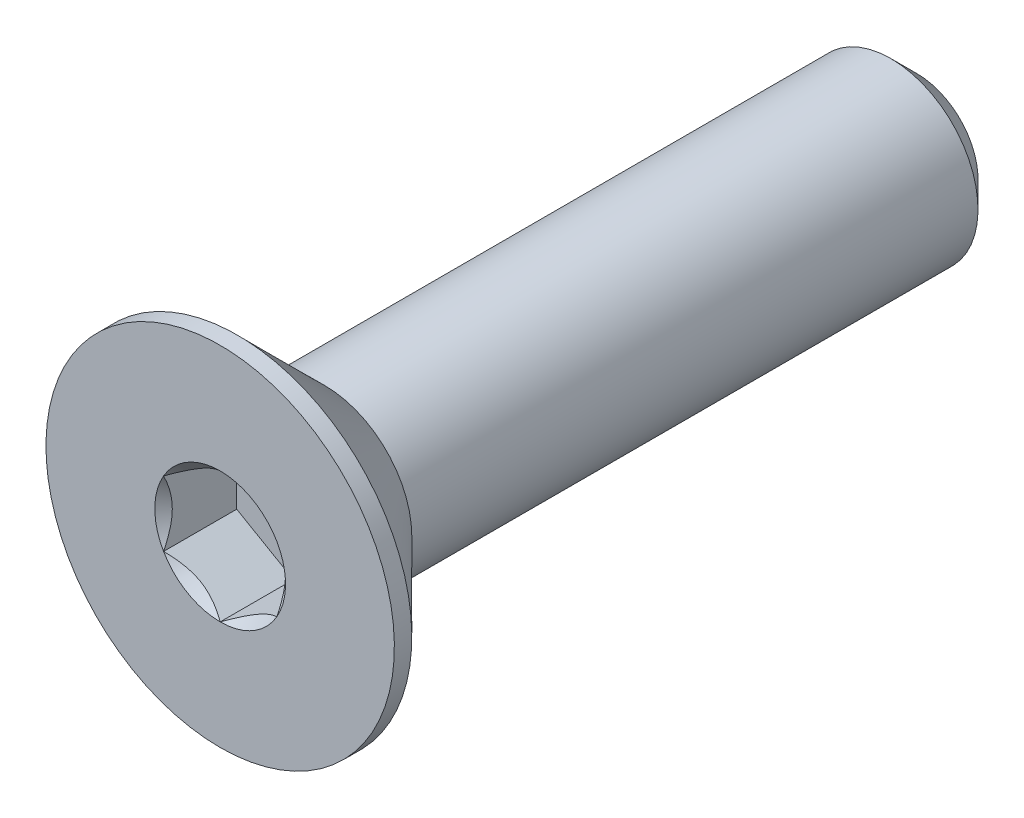
ISO-10303-21;
HEADER;
FILE_DESCRIPTION(('STEP AP214'),'2;1');
FILE_NAME('part.step','',(''),(''),'','','');
FILE_SCHEMA(('AUTOMOTIVE_DESIGN { 1 0 10303 214 1 1 1 1 }'));
ENDSEC;
DATA;
#1=APPLICATION_CONTEXT('core data for automotive mechanical design processes');
#2=APPLICATION_PROTOCOL_DEFINITION('international standard','automotive_design',2000,#1);
#3=PRODUCT_CONTEXT('',#1,'mechanical');
#4=PRODUCT('Part','Part','',(#3));
#5=PRODUCT_RELATED_PRODUCT_CATEGORY('part','',(#4));
#6=PRODUCT_DEFINITION_FORMATION('','',#4);
#7=PRODUCT_DEFINITION_CONTEXT('part definition',#1,'design');
#8=PRODUCT_DEFINITION('design','',#6,#7);
#9=PRODUCT_DEFINITION_SHAPE('','',#8);
#10=(LENGTH_UNIT() NAMED_UNIT(*) SI_UNIT(.MILLI.,.METRE.));
#11=(NAMED_UNIT(*) PLANE_ANGLE_UNIT() SI_UNIT($,.RADIAN.));
#12=(NAMED_UNIT(*) SI_UNIT($,.STERADIAN.) SOLID_ANGLE_UNIT());
#13=UNCERTAINTY_MEASURE_WITH_UNIT(LENGTH_MEASURE(1.E-05),#10,'distance_accuracy_value','');
#14=(GEOMETRIC_REPRESENTATION_CONTEXT(3) GLOBAL_UNCERTAINTY_ASSIGNED_CONTEXT((#13)) GLOBAL_UNIT_ASSIGNED_CONTEXT((#10,
#11,#12)) REPRESENTATION_CONTEXT('',''));
#15=CARTESIAN_POINT('',(0.,0.,0.));
#16=DIRECTION('',(0.,0.,1.));
#17=DIRECTION('',(1.,0.,0.));
#18=AXIS2_PLACEMENT_3D('',#15,#16,#17);
#19=CARTESIAN_POINT('',(0.,0.,-8.));
#20=DIRECTION('',(0.,0.,-1.));
#21=DIRECTION('',(0.,1.,0.));
#22=AXIS2_PLACEMENT_3D('',#19,#20,#21);
#23=CYLINDRICAL_SURFACE('',#22,0.999999999999998);
#24=CARTESIAN_POINT('',(0.,0.,-7.7));
#25=DIRECTION('',(0.,0.,-1.));
#26=DIRECTION('',(0.,1.,0.));
#27=AXIS2_PLACEMENT_3D('',#24,#25,#26);
#28=CIRCLE('',#27,0.999999999999998);
#29=CARTESIAN_POINT('',(0.,0.999999999999998,-7.7));
#30=VERTEX_POINT('',#29);
#31=EDGE_CURVE('E48',#30,#30,#28,.F.);
#32=ORIENTED_EDGE('',*,*,#31,.T.);
#33=EDGE_LOOP('',(#32));
#34=FACE_BOUND('',#33,.T.);
#35=CARTESIAN_POINT('',(0.,0.,-1.19999999999999));
#36=DIRECTION('',(0.,0.,1.));
#37=DIRECTION('',(0.,-1.,0.));
#38=AXIS2_PLACEMENT_3D('',#35,#36,#37);
#39=CIRCLE('',#38,1.00000000000001);
#40=CARTESIAN_POINT('',(0.,-1.00000000000001,-1.19999999999999));
#41=VERTEX_POINT('',#40);
#42=EDGE_CURVE('E166',#41,#41,#39,.T.);
#43=ORIENTED_EDGE('',*,*,#42,.F.);
#44=EDGE_LOOP('',(#43));
#45=FACE_BOUND('',#44,.T.);
#46=ADVANCED_FACE('F35',(#34,#45),#23,.T.);
#47=CARTESIAN_POINT('',(0.,-1.,-8.));
#48=DIRECTION('',(0.,0.,-1.));
#49=DIRECTION('',(0.,1.,0.));
#50=AXIS2_PLACEMENT_3D('',#47,#48,#49);
#51=PLANE('',#50);
#52=CARTESIAN_POINT('',(0.,0.,-8.));
#53=DIRECTION('',(0.,0.,-1.));
#54=DIRECTION('',(0.,1.,0.));
#55=AXIS2_PLACEMENT_3D('',#52,#53,#54);
#56=CIRCLE('',#55,0.700000000000001);
#57=CARTESIAN_POINT('',(0.,0.700000000000001,-8.));
#58=VERTEX_POINT('',#57);
#59=EDGE_CURVE('E175',#58,#58,#56,.T.);
#60=ORIENTED_EDGE('',*,*,#59,.T.);
#61=EDGE_LOOP('',(#60));
#62=FACE_BOUND('',#61,.T.);
#63=ADVANCED_FACE('F185',(#62),#51,.T.);
#64=CARTESIAN_POINT('',(0.,0.,-8.));
#65=DIRECTION('',(0.,0.,1.));
#66=DIRECTION('',(0.,-1.,0.));
#67=AXIS2_PLACEMENT_3D('',#64,#65,#66);
#68=CONICAL_SURFACE('',#67,0.700000000000001,0.785398163397445);
#69=ORIENTED_EDGE('',*,*,#31,.F.);
#70=EDGE_LOOP('',(#69));
#71=FACE_BOUND('',#70,.T.);
#72=ORIENTED_EDGE('',*,*,#59,.F.);
#73=EDGE_LOOP('',(#72));
#74=FACE_BOUND('',#73,.T.);
#75=ADVANCED_FACE('F37',(#71,#74),#68,.T.);
#76=CARTESIAN_POINT('',(0.,0.,0.));
#77=DIRECTION('',(0.,0.,1.));
#78=DIRECTION('',(0.,-1.,0.));
#79=AXIS2_PLACEMENT_3D('',#76,#77,#78);
#80=CYLINDRICAL_SURFACE('',#79,2.);
#81=CARTESIAN_POINT('',(0.,0.,0.));
#82=DIRECTION('',(0.,0.,1.));
#83=DIRECTION('',(0.,-1.,0.));
#84=AXIS2_PLACEMENT_3D('',#81,#82,#83);
#85=CIRCLE('',#84,1.99999999999999);
#86=CARTESIAN_POINT('',(0.,-1.99999999999999,0.));
#87=VERTEX_POINT('',#86);
#88=EDGE_CURVE('E172',#87,#87,#85,.T.);
#89=ORIENTED_EDGE('',*,*,#88,.F.);
#90=EDGE_LOOP('',(#89));
#91=FACE_BOUND('',#90,.T.);
#92=CARTESIAN_POINT('',(0.,0.,-0.199999999999994));
#93=DIRECTION('',(0.,0.,1.));
#94=DIRECTION('',(0.,-1.,0.));
#95=AXIS2_PLACEMENT_3D('',#92,#93,#94);
#96=CIRCLE('',#95,2.);
#97=CARTESIAN_POINT('',(0.,-2.,-0.199999999999984));
#98=VERTEX_POINT('',#97);
#99=EDGE_CURVE('E169',#98,#98,#96,.T.);
#100=ORIENTED_EDGE('',*,*,#99,.T.);
#101=EDGE_LOOP('',(#100));
#102=FACE_BOUND('',#101,.T.);
#103=ADVANCED_FACE('F184',(#91,#102),#80,.T.);
#104=CARTESIAN_POINT('',(0.,0.,-1.19999999999999));
#105=DIRECTION('',(0.,0.,1.));
#106=DIRECTION('',(0.,-1.,0.));
#107=AXIS2_PLACEMENT_3D('',#104,#105,#106);
#108=CONICAL_SURFACE('',#107,1.00000000000001,0.785398163397445);
#109=ORIENTED_EDGE('',*,*,#99,.F.);
#110=EDGE_LOOP('',(#109));
#111=FACE_BOUND('',#110,.T.);
#112=ORIENTED_EDGE('',*,*,#42,.T.);
#113=EDGE_LOOP('',(#112));
#114=FACE_BOUND('',#113,.T.);
#115=ADVANCED_FACE('F195',(#111,#114),#108,.T.);
#116=CARTESIAN_POINT('',(0.,-0.999999999999995,0.));
#117=DIRECTION('',(0.,0.,1.));
#118=DIRECTION('',(0.,-1.,0.));
#119=AXIS2_PLACEMENT_3D('',#116,#117,#118);
#120=PLANE('',#119);
#121=CARTESIAN_POINT('',(0.,0.,0.));
#122=DIRECTION('',(0.,0.,1.));
#123=DIRECTION('',(1.,0.,0.));
#124=AXIS2_PLACEMENT_3D('',#121,#122,#123);
#125=CIRCLE('',#124,0.750555349946514);
#126=CARTESIAN_POINT('',(0.,-0.750555349946514,0.));
#127=VERTEX_POINT('',#126);
#128=CARTESIAN_POINT('',(0.649999999999999,-0.375277674973259,0.));
#129=VERTEX_POINT('',#128);
#130=EDGE_CURVE('E94',#127,#129,#125,.T.);
#131=ORIENTED_EDGE('',*,*,#130,.F.);
#132=CARTESIAN_POINT('',(-0.65,-0.375277674973256,0.));
#133=VERTEX_POINT('',#132);
#134=EDGE_CURVE('E54',#133,#127,#125,.T.);
#135=ORIENTED_EDGE('',*,*,#134,.F.);
#136=CARTESIAN_POINT('',(-0.65,0.375277674973257,0.));
#137=VERTEX_POINT('',#136);
#138=EDGE_CURVE('E136',#137,#133,#125,.T.);
#139=ORIENTED_EDGE('',*,*,#138,.F.);
#140=CARTESIAN_POINT('',(0.,0.750555349946514,0.));
#141=VERTEX_POINT('',#140);
#142=EDGE_CURVE('E61',#141,#137,#125,.T.);
#143=ORIENTED_EDGE('',*,*,#142,.F.);
#144=CARTESIAN_POINT('',(0.65,0.375277674973259,0.));
#145=VERTEX_POINT('',#144);
#146=EDGE_CURVE('E130',#145,#141,#125,.T.);
#147=ORIENTED_EDGE('',*,*,#146,.F.);
#148=EDGE_CURVE('E102',#129,#145,#125,.T.);
#149=ORIENTED_EDGE('',*,*,#148,.F.);
#150=EDGE_LOOP('',(#131,#135,#139,#143,#147,#149));
#151=FACE_BOUND('',#150,.T.);
#152=ORIENTED_EDGE('',*,*,#88,.T.);
#153=EDGE_LOOP('',(#152));
#154=FACE_BOUND('',#153,.T.);
#155=ADVANCED_FACE('F128',(#151,#154),#120,.T.);
#156=CARTESIAN_POINT('',(0.,0.,0.));
#157=DIRECTION('',(0.,0.,1.));
#158=DIRECTION('',(1.,0.,0.));
#159=AXIS2_PLACEMENT_3D('',#156,#157,#158);
#160=CONICAL_SURFACE('',#159,0.750555349946514,0.78539816339745);
#161=ORIENTED_EDGE('',*,*,#148,.T.);
#162=CARTESIAN_POINT('',(0.649999999999999,-0.748456856202001,0.240750690384009));
#163=CARTESIAN_POINT('',(0.649999999999999,-0.711991073878824,0.213280285933624));
#164=CARTESIAN_POINT('',(0.649999999999999,-0.675139640082802,0.186265195476197));
#165=CARTESIAN_POINT('',(0.649999999999999,-0.600031183452826,0.133629348283165));
#166=CARTESIAN_POINT('',(0.649999999999999,-0.5617654412709,0.108021106129099));
#167=CARTESIAN_POINT('',(0.649999999999999,-0.481525479406325,0.0577374937624623));
#168=CARTESIAN_POINT('',(0.649999999999999,-0.43946425367049,0.0331988021987563));
#169=CARTESIAN_POINT('',(0.649999999999999,-0.353242719412722,-0.0116853403013642));
#170=CARTESIAN_POINT('',(0.649999999999999,-0.309090130602528,-0.0320449275105121));
#171=CARTESIAN_POINT('',(0.649999999999999,-0.242810057498672,-0.0569512709113486));
#172=CARTESIAN_POINT('',(0.649999999999999,-0.221667349821691,-0.0640992725852885));
#173=CARTESIAN_POINT('',(0.649999999999999,-0.178882845085544,-0.076702470547455));
#174=CARTESIAN_POINT('',(0.649999999999999,-0.157241013753965,-0.0821575502168753));
#175=CARTESIAN_POINT('',(0.649999999999999,-0.0924732258239357,-0.0953392346897772));
#176=CARTESIAN_POINT('',(0.649999999999999,-0.0486986201802788,-0.100206440230562));
#177=CARTESIAN_POINT('',(0.649999999999999,0.0373331587621226,-0.100855510769223));
#178=CARTESIAN_POINT('',(0.65,0.0795879418799254,-0.0969596606801959));
#179=CARTESIAN_POINT('',(0.65,0.142230570834974,-0.0855076744021686));
#180=CARTESIAN_POINT('',(0.65,0.163174856664668,-0.0806854357632721));
#181=CARTESIAN_POINT('',(0.65,0.204615212735412,-0.0693999000452593));
#182=CARTESIAN_POINT('',(0.65,0.225111320324616,-0.0629367402798584));
#183=CARTESIAN_POINT('',(0.65,0.289638534772369,-0.0401559078683602));
#184=CARTESIAN_POINT('',(0.65,0.332748206875049,-0.0212427548658019));
#185=CARTESIAN_POINT('',(0.65,0.416943840013232,0.0208112818887771));
#186=CARTESIAN_POINT('',(0.65,0.458021834530768,0.0439673547577746));
#187=CARTESIAN_POINT('',(0.65,0.536529233245988,0.091726639718087));
#188=CARTESIAN_POINT('',(0.65,0.57403850913462,0.116200758127151));
#189=CARTESIAN_POINT('',(0.65,0.647609691485455,0.166623456014881));
#190=CARTESIAN_POINT('',(0.65,0.683680924535917,0.192558343655286));
#191=CARTESIAN_POINT('',(0.65,0.719356204751139,0.218966877397429));
#192=B_SPLINE_CURVE_WITH_KNOTS('',3,(#162,#163,#164,#165,#166,#167,#168,#169,#170,#171,#172,
#173,#174,#175,#176,#177,#178,#179,#180,#181,#182,#183,#184,#185,#186,#187,#188,#189,#190,#191),
.UNSPECIFIED.,.F.,.F.,(4,2,2,2,2,2,2,2,2,2,2,2,2,2,4),(0.,0.13701403000958,0.275096405762554,
0.421060359835526,0.566522128775096,0.633415056462923,0.700312591121807,0.831534924508342,
0.958010408789905,1.02242898521266,1.08684217280829,1.22766018796413,1.36899252873704,
1.50330165960873,1.63651263433843),.UNSPECIFIED.);
#193=EDGE_CURVE('E11',#129,#145,#192,.T.);
#194=ORIENTED_EDGE('',*,*,#193,.F.);
#195=EDGE_LOOP('',(#161,#194));
#196=FACE_BOUND('',#195,.T.);
#197=ADVANCED_FACE('F106',(#196),#160,.F.);
#198=ORIENTED_EDGE('',*,*,#146,.T.);
#199=CARTESIAN_POINT('',(0.6502,0.37516220491942,0.000115496696673458));
#200=CARTESIAN_POINT('',(0.627846124557379,0.388068220923648,-0.0127826378084543));
#201=CARTESIAN_POINT('',(0.605119879467387,0.401189224644024,-0.0249248451013638));
#202=CARTESIAN_POINT('',(0.558778015356717,0.427944712363069,-0.0471577551377742));
#203=CARTESIAN_POINT('',(0.535157980959403,0.441581745580626,-0.0572360751899936));
#204=CARTESIAN_POINT('',(0.487526191293144,0.469081972166424,-0.0744984835766256));
#205=CARTESIAN_POINT('',(0.463526635406914,0.482938122217771,-0.081726041484421));
#206=CARTESIAN_POINT('',(0.415010589754791,0.51094887423504,-0.0928707979999935));
#207=CARTESIAN_POINT('',(0.390495555958119,0.525102635596742,-0.0967962973781322));
#208=CARTESIAN_POINT('',(0.33061559766408,0.559674345636868,-0.101776562665293));
#209=CARTESIAN_POINT('',(0.295110807096765,0.580173046028429,-0.100875515207342));
#210=CARTESIAN_POINT('',(0.224845447682006,0.620740770201246,-0.0915914386833312));
#211=CARTESIAN_POINT('',(0.190086069560698,0.640809106516447,-0.0831972369703435));
#212=CARTESIAN_POINT('',(0.129041737491061,0.676053068069353,-0.0629543214927022));
#213=CARTESIAN_POINT('',(0.102476138584915,0.691390723749,-0.0521615767354974));
#214=CARTESIAN_POINT('',(0.0503858451009331,0.721465068714143,-0.0278480685503982));
#215=CARTESIAN_POINT('',(0.024858081174964,0.736203530088611,-0.0143361789927107));
#216=CARTESIAN_POINT('',(-0.000200000000000232,0.750670820000352,0.000115496696674045));
#217=B_SPLINE_CURVE_WITH_KNOTS('',3,(#199,#200,#201,#202,#203,#204,#205,#206,#207,#208,#209,
#210,#211,#212,#213,#214,#215,#216),.UNSPECIFIED.,.F.,.F.,(4,2,2,2,2,2,2,2,4),(0.,
0.0866236559063443,0.173752711623242,0.259496442803568,0.345023980281752,0.467267720550125,
0.589694037029335,0.68711130875548,0.784215671813665),.UNSPECIFIED.);
#218=EDGE_CURVE('E132',#145,#141,#217,.T.);
#219=ORIENTED_EDGE('',*,*,#218,.F.);
#220=EDGE_LOOP('',(#198,#219));
#221=FACE_BOUND('',#220,.T.);
#222=ADVANCED_FACE('F271',(#221),#160,.F.);
#223=ORIENTED_EDGE('',*,*,#142,.T.);
#224=CARTESIAN_POINT('',(0.0001999999999998,0.750670820000352,0.000115496696674086));
#225=CARTESIAN_POINT('',(-0.0221538754426208,0.737764803996124,-0.0127826378084538));
#226=CARTESIAN_POINT('',(-0.0448801205326128,0.724643800275747,-0.0249248451013632));
#227=CARTESIAN_POINT('',(-0.0912219846432827,0.697888312556703,-0.0471577551377738));
#228=CARTESIAN_POINT('',(-0.114842019040597,0.684251279339146,-0.0572360751899932));
#229=CARTESIAN_POINT('',(-0.162473808706856,0.656751052753347,-0.0744984835766253));
#230=CARTESIAN_POINT('',(-0.186473364593086,0.642894902702001,-0.0817260414844208));
#231=CARTESIAN_POINT('',(-0.23498941024521,0.614884150684731,-0.0928707979999933));
#232=CARTESIAN_POINT('',(-0.259504444041881,0.60073038932303,-0.0967962973781321));
#233=CARTESIAN_POINT('',(-0.31938440233592,0.566158679282903,-0.101776562665293));
#234=CARTESIAN_POINT('',(-0.354889192903236,0.545659978891342,-0.100875515207342));
#235=CARTESIAN_POINT('',(-0.425154552317995,0.505092254718525,-0.0915914386833311));
#236=CARTESIAN_POINT('',(-0.459913930439302,0.485023918403324,-0.0831972369703433));
#237=CARTESIAN_POINT('',(-0.52095826250894,0.449779956850418,-0.0629543214927021));
#238=CARTESIAN_POINT('',(-0.547523861415086,0.434442301170771,-0.0521615767354973));
#239=CARTESIAN_POINT('',(-0.599614154899067,0.404367956205628,-0.0278480685503983));
#240=CARTESIAN_POINT('',(-0.625141918825036,0.38962949483116,-0.0143361789927108));
#241=CARTESIAN_POINT('',(-0.6502,0.375162204919419,0.000115496696673951));
#242=B_SPLINE_CURVE_WITH_KNOTS('',3,(#224,#225,#226,#227,#228,#229,#230,#231,#232,#233,#234,
#235,#236,#237,#238,#239,#240,#241),.UNSPECIFIED.,.F.,.F.,(4,2,2,2,2,2,2,2,4),(0.,
0.0866236559063444,0.173752711623242,0.259496442803568,0.345023980281753,0.467267720550126,
0.589694037029337,0.687111308755481,0.784215671813666),.UNSPECIFIED.);
#243=EDGE_CURVE('E135',#141,#137,#242,.T.);
#244=ORIENTED_EDGE('',*,*,#243,.F.);
#245=EDGE_LOOP('',(#223,#244));
#246=FACE_BOUND('',#245,.T.);
#247=ADVANCED_FACE('F267',(#246),#160,.F.);
#248=ORIENTED_EDGE('',*,*,#138,.T.);
#249=CARTESIAN_POINT('',(-0.65,-0.748456856202,0.240750690384009));
#250=CARTESIAN_POINT('',(-0.65,-0.711991073878823,0.213280285933624));
#251=CARTESIAN_POINT('',(-0.65,-0.675139640082801,0.186265195476196));
#252=CARTESIAN_POINT('',(-0.65,-0.600031183452825,0.133629348283165));
#253=CARTESIAN_POINT('',(-0.65,-0.561765441270899,0.108021106129099));
#254=CARTESIAN_POINT('',(-0.65,-0.481525479406325,0.0577374937624624));
#255=CARTESIAN_POINT('',(-0.65,-0.439464253670489,0.0331988021987566));
#256=CARTESIAN_POINT('',(-0.65,-0.353242719412722,-0.0116853403013638));
#257=CARTESIAN_POINT('',(-0.65,-0.309090130602527,-0.0320449275105118));
#258=CARTESIAN_POINT('',(-0.65,-0.242810057498671,-0.0569512709113481));
#259=CARTESIAN_POINT('',(-0.65,-0.22166734982169,-0.0640992725852878));
#260=CARTESIAN_POINT('',(-0.65,-0.178882845085544,-0.0767024705474542));
#261=CARTESIAN_POINT('',(-0.65,-0.157241013753965,-0.0821575502168746));
#262=CARTESIAN_POINT('',(-0.65,-0.0924732258239351,-0.0953392346897765));
#263=CARTESIAN_POINT('',(-0.65,-0.0486986201802782,-0.100206440230561));
#264=CARTESIAN_POINT('',(-0.65,0.0373331587621233,-0.100855510769222));
#265=CARTESIAN_POINT('',(-0.65,0.0795879418799262,-0.096959660680195));
#266=CARTESIAN_POINT('',(-0.65,0.142230570834975,-0.0855076744021676));
#267=CARTESIAN_POINT('',(-0.65,0.163174856664668,-0.0806854357632711));
#268=CARTESIAN_POINT('',(-0.65,0.204615212735413,-0.0693999000452582));
#269=CARTESIAN_POINT('',(-0.65,0.225111320324616,-0.0629367402798573));
#270=CARTESIAN_POINT('',(-0.65,0.28963853477237,-0.0401559078683591));
#271=CARTESIAN_POINT('',(-0.65,0.33274820687505,-0.0212427548658007));
#272=CARTESIAN_POINT('',(-0.65,0.416943840013233,0.0208112818887785));
#273=CARTESIAN_POINT('',(-0.65,0.458021834530769,0.043967354757776));
#274=CARTESIAN_POINT('',(-0.65,0.536529233245989,0.0917266397180885));
#275=CARTESIAN_POINT('',(-0.65,0.574038509134621,0.116200758127153));
#276=CARTESIAN_POINT('',(-0.65,0.647609691485456,0.166623456014883));
#277=CARTESIAN_POINT('',(-0.65,0.683680924535919,0.192558343655288));
#278=CARTESIAN_POINT('',(-0.65,0.719356204751141,0.218966877397431));
#279=B_SPLINE_CURVE_WITH_KNOTS('',3,(#249,#250,#251,#252,#253,#254,#255,#256,#257,#258,#259,
#260,#261,#262,#263,#264,#265,#266,#267,#268,#269,#270,#271,#272,#273,#274,#275,#276,#277,#278),
.UNSPECIFIED.,.F.,.F.,(4,2,2,2,2,2,2,2,2,2,2,2,2,2,4),(0.,0.13701403000958,0.275096405762554,
0.421060359835526,0.566522128775095,0.633415056462922,0.700312591121806,0.831534924508341,
0.958010408789904,1.02242898521266,1.08684217280829,1.22766018796413,1.36899252873704,
1.50330165960874,1.63651263433843),.UNSPECIFIED.);
#280=EDGE_CURVE('E142',#137,#133,#279,.F.);
#281=ORIENTED_EDGE('',*,*,#280,.F.);
#282=EDGE_LOOP('',(#248,#281));
#283=FACE_BOUND('',#282,.T.);
#284=ADVANCED_FACE('F140',(#283),#160,.F.);
#285=ORIENTED_EDGE('',*,*,#134,.T.);
#286=CARTESIAN_POINT('',(-0.6502,-0.375162204919418,0.000115496696673349));
#287=CARTESIAN_POINT('',(-0.62784612455738,-0.388068220923647,-0.0127826378084544));
#288=CARTESIAN_POINT('',(-0.605119879467388,-0.401189224644023,-0.0249248451013639));
#289=CARTESIAN_POINT('',(-0.558778015356718,-0.427944712363067,-0.0471577551377745));
#290=CARTESIAN_POINT('',(-0.535157980959404,-0.441581745580625,-0.057236075189994));
#291=CARTESIAN_POINT('',(-0.487526191293144,-0.469081972166423,-0.0744984835766262));
#292=CARTESIAN_POINT('',(-0.463526635406914,-0.48293812221777,-0.0817260414844217));
#293=CARTESIAN_POINT('',(-0.415010589754791,-0.510948874235039,-0.0928707979999942));
#294=CARTESIAN_POINT('',(-0.390495555958119,-0.525102635596741,-0.096796297378133));
#295=CARTESIAN_POINT('',(-0.33061559766408,-0.559674345636868,-0.101776562665294));
#296=CARTESIAN_POINT('',(-0.295110807096765,-0.580173046028428,-0.100875515207343));
#297=CARTESIAN_POINT('',(-0.224845447682006,-0.620740770201245,-0.091591438683332));
#298=CARTESIAN_POINT('',(-0.190086069560699,-0.640809106516446,-0.0831972369703444));
#299=CARTESIAN_POINT('',(-0.129041737491061,-0.676053068069352,-0.0629543214927031));
#300=CARTESIAN_POINT('',(-0.102476138584915,-0.691390723748999,-0.0521615767354983));
#301=CARTESIAN_POINT('',(-0.0503858451009336,-0.721465068714142,-0.0278480685503992));
#302=CARTESIAN_POINT('',(-0.0248580811749646,-0.73620353008861,-0.0143361789927117));
#303=CARTESIAN_POINT('',(0.000199999999999682,-0.750670820000351,0.000115496696672961));
#304=B_SPLINE_CURVE_WITH_KNOTS('',3,(#286,#287,#288,#289,#290,#291,#292,#293,#294,#295,#296,
#297,#298,#299,#300,#301,#302,#303),.UNSPECIFIED.,.F.,.F.,(4,2,2,2,2,2,2,2,4),(0.,
0.0866236559063445,0.173752711623243,0.259496442803569,0.345023980281753,0.467267720550126,
0.589694037029336,0.687111308755481,0.784215671813666),.UNSPECIFIED.);
#305=EDGE_CURVE('E118',#133,#127,#304,.T.);
#306=ORIENTED_EDGE('',*,*,#305,.F.);
#307=EDGE_LOOP('',(#285,#306));
#308=FACE_BOUND('',#307,.T.);
#309=ADVANCED_FACE('F222',(#308),#160,.F.);
#310=ORIENTED_EDGE('',*,*,#130,.T.);
#311=CARTESIAN_POINT('',(-0.000200000000000307,-0.750670820000351,0.000115496696673002));
#312=CARTESIAN_POINT('',(0.0221538754426203,-0.737764803996123,-0.0127826378084549));
#313=CARTESIAN_POINT('',(0.0448801205326123,-0.724643800275746,-0.0249248451013644));
#314=CARTESIAN_POINT('',(0.0912219846432822,-0.697888312556702,-0.0471577551377749));
#315=CARTESIAN_POINT('',(0.114842019040596,-0.684251279339145,-0.0572360751899943));
#316=CARTESIAN_POINT('',(0.162473808706856,-0.656751052753346,-0.0744984835766264));
#317=CARTESIAN_POINT('',(0.186473364593086,-0.642894902702,-0.0817260414844219));
#318=CARTESIAN_POINT('',(0.234989410245209,-0.61488415068473,-0.0928707979999943));
#319=CARTESIAN_POINT('',(0.259504444041881,-0.600730389323029,-0.096796297378133));
#320=CARTESIAN_POINT('',(0.31938440233592,-0.566158679282902,-0.101776562665294));
#321=CARTESIAN_POINT('',(0.354889192903235,-0.545659978891341,-0.100875515207343));
#322=CARTESIAN_POINT('',(0.425154552317994,-0.505092254718524,-0.0915914386833321));
#323=CARTESIAN_POINT('',(0.459913930439301,-0.485023918403324,-0.0831972369703443));
#324=CARTESIAN_POINT('',(0.520958262508939,-0.449779956850417,-0.062954321492703));
#325=CARTESIAN_POINT('',(0.547523861415085,-0.434442301170771,-0.0521615767354983));
#326=CARTESIAN_POINT('',(0.599614154899066,-0.404367956205627,-0.0278480685503993));
#327=CARTESIAN_POINT('',(0.625141918825035,-0.38962949483116,-0.0143361789927119));
#328=CARTESIAN_POINT('',(0.650199999999999,-0.375162204919419,0.000115496696672908));
#329=B_SPLINE_CURVE_WITH_KNOTS('',3,(#311,#312,#313,#314,#315,#316,#317,#318,#319,#320,#321,
#322,#323,#324,#325,#326,#327,#328),.UNSPECIFIED.,.F.,.F.,(4,2,2,2,2,2,2,2,4),(0.,
0.0866236559063445,0.173752711623243,0.259496442803568,0.345023980281753,0.467267720550125,
0.589694037029336,0.687111308755481,0.784215671813665),.UNSPECIFIED.);
#330=EDGE_CURVE('E98',#127,#129,#329,.T.);
#331=ORIENTED_EDGE('',*,*,#330,.F.);
#332=EDGE_LOOP('',(#310,#331));
#333=FACE_BOUND('',#332,.T.);
#334=ADVANCED_FACE('F96',(#333),#160,.F.);
#335=CARTESIAN_POINT('',(0.649999999999999,-0.375277674973257,-0.84));
#336=DIRECTION('',(0.,0.,1.));
#337=DIRECTION('',(1.,0.,0.));
#338=AXIS2_PLACEMENT_3D('',#335,#336,#337);
#339=PLANE('',#338);
#340=DIRECTION('',(0.866025403784439,0.5,0.));
#341=VECTOR('',#340,1.);
#342=CARTESIAN_POINT('',(0.,-0.750555349946513,-0.84));
#343=LINE('',#342,#341);
#344=CARTESIAN_POINT('',(0.,-0.750555349946513,-0.84));
#345=VERTEX_POINT('',#344);
#346=CARTESIAN_POINT('',(0.649999999999999,-0.375277674973257,-0.84));
#347=VERTEX_POINT('',#346);
#348=EDGE_CURVE('E117',#345,#347,#343,.T.);
#349=ORIENTED_EDGE('',*,*,#348,.T.);
#350=DIRECTION('',(0.,1.,0.));
#351=VECTOR('',#350,1.);
#352=CARTESIAN_POINT('',(0.649999999999999,-0.375277674973257,-0.84));
#353=LINE('',#352,#351);
#354=CARTESIAN_POINT('',(0.65,0.375277674973258,-0.84));
#355=VERTEX_POINT('',#354);
#356=EDGE_CURVE('E122',#347,#355,#353,.T.);
#357=ORIENTED_EDGE('',*,*,#356,.T.);
#358=DIRECTION('',(-0.866025403784439,0.5,0.));
#359=VECTOR('',#358,1.);
#360=CARTESIAN_POINT('',(0.65,0.375277674973258,-0.84));
#361=LINE('',#360,#359);
#362=CARTESIAN_POINT('',(0.,0.750555349946514,-0.84));
#363=VERTEX_POINT('',#362);
#364=EDGE_CURVE('E253',#355,#363,#361,.T.);
#365=ORIENTED_EDGE('',*,*,#364,.T.);
#366=DIRECTION('',(-0.866025403784439,-0.5,0.));
#367=VECTOR('',#366,1.);
#368=CARTESIAN_POINT('',(0.,0.750555349946514,-0.84));
#369=LINE('',#368,#367);
#370=CARTESIAN_POINT('',(-0.65,0.375277674973257,-0.84));
#371=VERTEX_POINT('',#370);
#372=EDGE_CURVE('E255',#363,#371,#369,.T.);
#373=ORIENTED_EDGE('',*,*,#372,.T.);
#374=DIRECTION('',(0.,-1.,0.));
#375=VECTOR('',#374,1.);
#376=CARTESIAN_POINT('',(-0.65,0.375277674973257,-0.84));
#377=LINE('',#376,#375);
#378=CARTESIAN_POINT('',(-0.65,-0.375277674973256,-0.84));
#379=VERTEX_POINT('',#378);
#380=EDGE_CURVE('E157',#371,#379,#377,.T.);
#381=ORIENTED_EDGE('',*,*,#380,.T.);
#382=DIRECTION('',(0.866025403784439,-0.5,0.));
#383=VECTOR('',#382,1.);
#384=CARTESIAN_POINT('',(-0.65,-0.375277674973256,-0.84));
#385=LINE('',#384,#383);
#386=EDGE_CURVE('E125',#379,#345,#385,.T.);
#387=ORIENTED_EDGE('',*,*,#386,.T.);
#388=EDGE_LOOP('',(#349,#357,#365,#373,#381,#387));
#389=FACE_BOUND('',#388,.T.);
#390=ADVANCED_FACE('F221',(#389),#339,.T.);
#391=CARTESIAN_POINT('',(0.649999999999999,-0.375277674973257,-0.84));
#392=DIRECTION('',(1.,0.,0.));
#393=DIRECTION('',(0.,1.,0.));
#394=AXIS2_PLACEMENT_3D('',#391,#392,#393);
#395=PLANE('',#394);
#396=DIRECTION('',(0.,0.,1.));
#397=VECTOR('',#396,1.);
#398=CARTESIAN_POINT('',(0.649999999999999,-0.375277674973257,-0.84));
#399=LINE('',#398,#397);
#400=EDGE_CURVE('E114',#347,#129,#399,.T.);
#401=ORIENTED_EDGE('',*,*,#400,.T.);
#402=ORIENTED_EDGE('',*,*,#193,.T.);
#403=DIRECTION('',(0.,0.,1.));
#404=VECTOR('',#403,1.);
#405=CARTESIAN_POINT('',(0.65,0.375277674973258,-0.84));
#406=LINE('',#405,#404);
#407=EDGE_CURVE('E124',#355,#145,#406,.T.);
#408=ORIENTED_EDGE('',*,*,#407,.F.);
#409=ORIENTED_EDGE('',*,*,#356,.F.);
#410=EDGE_LOOP('',(#401,#402,#408,#409));
#411=FACE_BOUND('',#410,.T.);
#412=ADVANCED_FACE('F120',(#411),#395,.F.);
#413=CARTESIAN_POINT('',(0.65,0.375277674973258,-0.84));
#414=DIRECTION('',(0.5,0.866025403784439,0.));
#415=DIRECTION('',(-0.866025403784439,0.5,0.));
#416=AXIS2_PLACEMENT_3D('',#413,#414,#415);
#417=PLANE('',#416);
#418=ORIENTED_EDGE('',*,*,#407,.T.);
#419=ORIENTED_EDGE('',*,*,#218,.T.);
#420=DIRECTION('',(0.,0.,1.));
#421=VECTOR('',#420,1.);
#422=CARTESIAN_POINT('',(0.,0.750555349946514,-0.84));
#423=LINE('',#422,#421);
#424=EDGE_CURVE('E153',#363,#141,#423,.T.);
#425=ORIENTED_EDGE('',*,*,#424,.F.);
#426=ORIENTED_EDGE('',*,*,#364,.F.);
#427=EDGE_LOOP('',(#418,#419,#425,#426));
#428=FACE_BOUND('',#427,.T.);
#429=ADVANCED_FACE('F244',(#428),#417,.F.);
#430=CARTESIAN_POINT('',(0.,0.750555349946514,-0.84));
#431=DIRECTION('',(-0.5,0.866025403784439,0.));
#432=DIRECTION('',(-0.866025403784439,-0.5,0.));
#433=AXIS2_PLACEMENT_3D('',#430,#431,#432);
#434=PLANE('',#433);
#435=ORIENTED_EDGE('',*,*,#424,.T.);
#436=ORIENTED_EDGE('',*,*,#243,.T.);
#437=DIRECTION('',(0.,0.,1.));
#438=VECTOR('',#437,1.);
#439=CARTESIAN_POINT('',(-0.65,0.375277674973257,-0.84));
#440=LINE('',#439,#438);
#441=EDGE_CURVE('E151',#371,#137,#440,.T.);
#442=ORIENTED_EDGE('',*,*,#441,.F.);
#443=ORIENTED_EDGE('',*,*,#372,.F.);
#444=EDGE_LOOP('',(#435,#436,#442,#443));
#445=FACE_BOUND('',#444,.T.);
#446=ADVANCED_FACE('F149',(#445),#434,.F.);
#447=CARTESIAN_POINT('',(-0.65,0.375277674973257,-0.84));
#448=DIRECTION('',(-1.,0.,0.));
#449=DIRECTION('',(0.,-1.,0.));
#450=AXIS2_PLACEMENT_3D('',#447,#448,#449);
#451=PLANE('',#450);
#452=ORIENTED_EDGE('',*,*,#441,.T.);
#453=ORIENTED_EDGE('',*,*,#280,.T.);
#454=DIRECTION('',(0.,0.,1.));
#455=VECTOR('',#454,1.);
#456=CARTESIAN_POINT('',(-0.65,-0.375277674973256,-0.84));
#457=LINE('',#456,#455);
#458=EDGE_CURVE('E159',#379,#133,#457,.T.);
#459=ORIENTED_EDGE('',*,*,#458,.F.);
#460=ORIENTED_EDGE('',*,*,#380,.F.);
#461=EDGE_LOOP('',(#452,#453,#459,#460));
#462=FACE_BOUND('',#461,.T.);
#463=ADVANCED_FACE('F155',(#462),#451,.F.);
#464=CARTESIAN_POINT('',(-0.65,-0.375277674973256,-0.84));
#465=DIRECTION('',(-0.5,-0.866025403784439,0.));
#466=DIRECTION('',(0.866025403784439,-0.5,0.));
#467=AXIS2_PLACEMENT_3D('',#464,#465,#466);
#468=PLANE('',#467);
#469=ORIENTED_EDGE('',*,*,#458,.T.);
#470=ORIENTED_EDGE('',*,*,#305,.T.);
#471=DIRECTION('',(0.,0.,1.));
#472=VECTOR('',#471,1.);
#473=CARTESIAN_POINT('',(0.,-0.750555349946513,-0.84));
#474=LINE('',#473,#472);
#475=EDGE_CURVE('E116',#345,#127,#474,.T.);
#476=ORIENTED_EDGE('',*,*,#475,.F.);
#477=ORIENTED_EDGE('',*,*,#386,.F.);
#478=EDGE_LOOP('',(#469,#470,#476,#477));
#479=FACE_BOUND('',#478,.T.);
#480=ADVANCED_FACE('F205',(#479),#468,.F.);
#481=CARTESIAN_POINT('',(0.,-0.750555349946513,-0.84));
#482=DIRECTION('',(0.5,-0.866025403784439,0.));
#483=DIRECTION('',(0.866025403784439,0.5,0.));
#484=AXIS2_PLACEMENT_3D('',#481,#482,#483);
#485=PLANE('',#484);
#486=ORIENTED_EDGE('',*,*,#475,.T.);
#487=ORIENTED_EDGE('',*,*,#330,.T.);
#488=ORIENTED_EDGE('',*,*,#400,.F.);
#489=ORIENTED_EDGE('',*,*,#348,.F.);
#490=EDGE_LOOP('',(#486,#487,#488,#489));
#491=FACE_BOUND('',#490,.T.);
#492=ADVANCED_FACE('F112',(#491),#485,.F.);
#493=CLOSED_SHELL('',(#46,#63,#75,#103,#115,#155,#197,#222,#247,#284,#309,#334,#390,#412,#429,
#446,#463,#480,#492));
#494=MANIFOLD_SOLID_BREP('B2',#493);
#495=ADVANCED_BREP_SHAPE_REPRESENTATION('',(#18,#494),#14);
#496=SHAPE_DEFINITION_REPRESENTATION(#9,#495);
ENDSEC;
END-ISO-10303-21;
